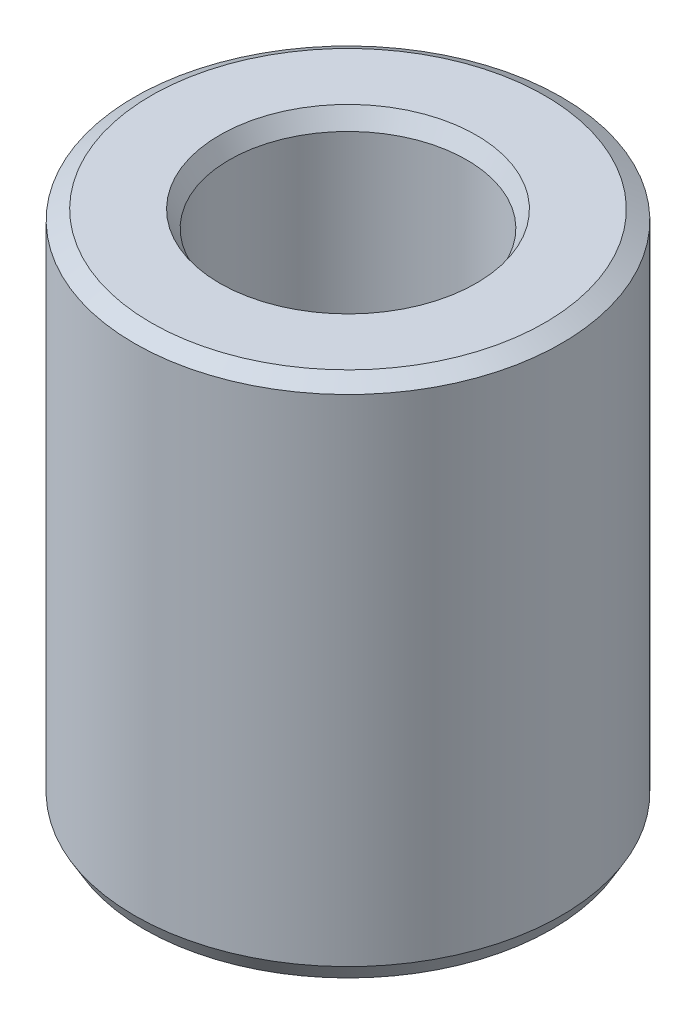
ISO-10303-21;
HEADER;
FILE_DESCRIPTION(('STEP AP214'),'2;1');
FILE_NAME('part.step','',(''),(''),'','','');
FILE_SCHEMA(('AUTOMOTIVE_DESIGN { 1 0 10303 214 1 1 1 1 }'));
ENDSEC;
DATA;
#1=APPLICATION_CONTEXT('core data for automotive mechanical design processes');
#2=APPLICATION_PROTOCOL_DEFINITION('international standard','automotive_design',2000,#1);
#3=PRODUCT_CONTEXT('',#1,'mechanical');
#4=PRODUCT('Part','Part','',(#3));
#5=PRODUCT_RELATED_PRODUCT_CATEGORY('part','',(#4));
#6=PRODUCT_DEFINITION_FORMATION('','',#4);
#7=PRODUCT_DEFINITION_CONTEXT('part definition',#1,'design');
#8=PRODUCT_DEFINITION('design','',#6,#7);
#9=PRODUCT_DEFINITION_SHAPE('','',#8);
#10=(LENGTH_UNIT() NAMED_UNIT(*) SI_UNIT(.MILLI.,.METRE.));
#11=(NAMED_UNIT(*) PLANE_ANGLE_UNIT() SI_UNIT($,.RADIAN.));
#12=(NAMED_UNIT(*) SI_UNIT($,.STERADIAN.) SOLID_ANGLE_UNIT());
#13=UNCERTAINTY_MEASURE_WITH_UNIT(LENGTH_MEASURE(1.E-05),#10,'distance_accuracy_value','');
#14=(GEOMETRIC_REPRESENTATION_CONTEXT(3) GLOBAL_UNCERTAINTY_ASSIGNED_CONTEXT((#13)) GLOBAL_UNIT_ASSIGNED_CONTEXT((#10,
#11,#12)) REPRESENTATION_CONTEXT('',''));
#15=CARTESIAN_POINT('',(0.,0.,0.));
#16=DIRECTION('',(0.,0.,1.));
#17=DIRECTION('',(1.,0.,0.));
#18=AXIS2_PLACEMENT_3D('',#15,#16,#17);
#19=CARTESIAN_POINT('',(0.,85.541448278443,0.));
#20=DIRECTION('',(0.,-1.,0.));
#21=DIRECTION('',(0.,0.,-1.));
#22=AXIS2_PLACEMENT_3D('',#19,#20,#21);
#23=CYLINDRICAL_SURFACE('',#22,35.);
#24=CARTESIAN_POINT('',(0.,2.72550945198191,0.));
#25=DIRECTION('',(0.,1.,0.));
#26=DIRECTION('',(0.,0.,1.));
#27=AXIS2_PLACEMENT_3D('',#24,#25,#26);
#28=CIRCLE('',#27,35.);
#29=CARTESIAN_POINT('',(0.,2.72550945198191,35.));
#30=VERTEX_POINT('',#29);
#31=EDGE_CURVE('E10',#30,#30,#28,.T.);
#32=ORIENTED_EDGE('',*,*,#31,.T.);
#33=EDGE_LOOP('',(#32));
#34=FACE_BOUND('',#33,.T.);
#35=CARTESIAN_POINT('',(0.,83.9678746626624,0.));
#36=DIRECTION('',(0.,1.,0.));
#37=DIRECTION('',(0.,0.,1.));
#38=AXIS2_PLACEMENT_3D('',#35,#36,#37);
#39=CIRCLE('',#38,35.);
#40=CARTESIAN_POINT('',(0.,83.9678746626624,35.));
#41=VERTEX_POINT('',#40);
#42=EDGE_CURVE('E50',#41,#41,#39,.F.);
#43=ORIENTED_EDGE('',*,*,#42,.T.);
#44=EDGE_LOOP('',(#43));
#45=FACE_BOUND('',#44,.T.);
#46=ADVANCED_FACE('F39',(#34,#45),#23,.T.);
#47=CARTESIAN_POINT('',(0.,85.541448278443,0.));
#48=DIRECTION('',(0.,1.,0.));
#49=DIRECTION('',(0.,0.,1.));
#50=AXIS2_PLACEMENT_3D('',#47,#48,#49);
#51=PLANE('',#50);
#52=CARTESIAN_POINT('',(0.,85.541448278443,0.));
#53=DIRECTION('',(0.,1.,0.));
#54=DIRECTION('',(0.,0.,1.));
#55=AXIS2_PLACEMENT_3D('',#52,#53,#54);
#56=CIRCLE('',#55,21.0417153686757);
#57=CARTESIAN_POINT('',(0.,85.541448278443,21.0417153686757));
#58=VERTEX_POINT('',#57);
#59=EDGE_CURVE('E58',#58,#58,#56,.F.);
#60=ORIENTED_EDGE('',*,*,#59,.T.);
#61=EDGE_LOOP('',(#60));
#62=FACE_BOUND('',#61,.T.);
#63=CARTESIAN_POINT('',(0.,85.541448278443,0.));
#64=DIRECTION('',(0.,1.,0.));
#65=DIRECTION('',(0.,0.,1.));
#66=AXIS2_PLACEMENT_3D('',#63,#64,#65);
#67=CIRCLE('',#66,32.2744905480182);
#68=CARTESIAN_POINT('',(0.,85.541448278443,32.2744905480182));
#69=VERTEX_POINT('',#68);
#70=EDGE_CURVE('E61',#69,#69,#67,.T.);
#71=ORIENTED_EDGE('',*,*,#70,.T.);
#72=EDGE_LOOP('',(#71));
#73=FACE_BOUND('',#72,.T.);
#74=ADVANCED_FACE('F88',(#62,#73),#51,.T.);
#75=CARTESIAN_POINT('',(0.,0.,0.));
#76=DIRECTION('',(0.,1.,0.));
#77=DIRECTION('',(0.,0.,1.));
#78=AXIS2_PLACEMENT_3D('',#75,#76,#77);
#79=PLANE('',#78);
#80=CARTESIAN_POINT('',(0.,0.,0.));
#81=DIRECTION('',(0.,1.,0.));
#82=DIRECTION('',(0.,0.,1.));
#83=AXIS2_PLACEMENT_3D('',#80,#81,#82);
#84=CIRCLE('',#83,22.193651204877);
#85=CARTESIAN_POINT('',(0.,0.,22.193651204877));
#86=VERTEX_POINT('',#85);
#87=EDGE_CURVE('E51',#86,#86,#84,.T.);
#88=ORIENTED_EDGE('',*,*,#87,.T.);
#89=EDGE_LOOP('',(#88));
#90=FACE_BOUND('',#89,.T.);
#91=CARTESIAN_POINT('',(0.,0.,0.));
#92=DIRECTION('',(0.,1.,0.));
#93=DIRECTION('',(0.,0.,1.));
#94=AXIS2_PLACEMENT_3D('',#91,#92,#93);
#95=CIRCLE('',#94,33.4264263842194);
#96=CARTESIAN_POINT('',(0.,0.,33.4264263842194));
#97=VERTEX_POINT('',#96);
#98=EDGE_CURVE('E54',#97,#97,#95,.F.);
#99=ORIENTED_EDGE('',*,*,#98,.T.);
#100=EDGE_LOOP('',(#99));
#101=FACE_BOUND('',#100,.T.);
#102=ADVANCED_FACE('F83',(#90,#101),#79,.F.);
#103=CARTESIAN_POINT('',(0.,85.541448278443,0.));
#104=DIRECTION('',(0.,-1.,0.));
#105=DIRECTION('',(0.,0.,-1.));
#106=AXIS2_PLACEMENT_3D('',#103,#104,#105);
#107=CYLINDRICAL_SURFACE('',#106,19.4681417528951);
#108=CARTESIAN_POINT('',(0.,82.8159388264611,0.));
#109=DIRECTION('',(0.,1.,0.));
#110=DIRECTION('',(0.,0.,1.));
#111=AXIS2_PLACEMENT_3D('',#108,#109,#110);
#112=CIRCLE('',#111,19.4681417528951);
#113=CARTESIAN_POINT('',(0.,82.8159388264611,19.4681417528951));
#114=VERTEX_POINT('',#113);
#115=EDGE_CURVE('E67',#114,#114,#112,.T.);
#116=ORIENTED_EDGE('',*,*,#115,.T.);
#117=EDGE_LOOP('',(#116));
#118=FACE_BOUND('',#117,.T.);
#119=CARTESIAN_POINT('',(0.,1.57357361578062,0.));
#120=DIRECTION('',(0.,1.,0.));
#121=DIRECTION('',(0.,0.,1.));
#122=AXIS2_PLACEMENT_3D('',#119,#120,#121);
#123=CIRCLE('',#122,19.4681417528951);
#124=CARTESIAN_POINT('',(0.,1.57357361578062,19.4681417528951));
#125=VERTEX_POINT('',#124);
#126=EDGE_CURVE('E69',#125,#125,#123,.F.);
#127=ORIENTED_EDGE('',*,*,#126,.T.);
#128=EDGE_LOOP('',(#127));
#129=FACE_BOUND('',#128,.T.);
#130=ADVANCED_FACE('F71',(#118,#129),#107,.F.);
#131=CARTESIAN_POINT('',(0.,82.8159388264611,0.));
#132=DIRECTION('',(0.,1.,0.));
#133=DIRECTION('',(0.,0.,1.));
#134=AXIS2_PLACEMENT_3D('',#131,#132,#133);
#135=CONICAL_SURFACE('',#134,19.4681417528951,0.523598775598295);
#136=ORIENTED_EDGE('',*,*,#59,.F.);
#137=EDGE_LOOP('',(#136));
#138=FACE_BOUND('',#137,.T.);
#139=ORIENTED_EDGE('',*,*,#115,.F.);
#140=EDGE_LOOP('',(#139));
#141=FACE_BOUND('',#140,.T.);
#142=ADVANCED_FACE('F77',(#138,#141),#135,.F.);
#143=CARTESIAN_POINT('',(0.,0.,0.));
#144=DIRECTION('',(0.,-1.,0.));
#145=DIRECTION('',(0.,0.,-1.));
#146=AXIS2_PLACEMENT_3D('',#143,#144,#145);
#147=CONICAL_SURFACE('',#146,22.193651204877,1.04719755119659);
#148=ORIENTED_EDGE('',*,*,#126,.F.);
#149=EDGE_LOOP('',(#148));
#150=FACE_BOUND('',#149,.T.);
#151=ORIENTED_EDGE('',*,*,#87,.F.);
#152=EDGE_LOOP('',(#151));
#153=FACE_BOUND('',#152,.T.);
#154=ADVANCED_FACE('F73',(#150,#153),#147,.F.);
#155=CARTESIAN_POINT('',(0.,2.72550945198191,0.));
#156=DIRECTION('',(0.,1.,0.));
#157=DIRECTION('',(0.,0.,1.));
#158=AXIS2_PLACEMENT_3D('',#155,#156,#157);
#159=CONICAL_SURFACE('',#158,35.,0.523598775598302);
#160=ORIENTED_EDGE('',*,*,#98,.F.);
#161=EDGE_LOOP('',(#160));
#162=FACE_BOUND('',#161,.T.);
#163=ORIENTED_EDGE('',*,*,#31,.F.);
#164=EDGE_LOOP('',(#163));
#165=FACE_BOUND('',#164,.T.);
#166=ADVANCED_FACE('F76',(#162,#165),#159,.T.);
#167=CARTESIAN_POINT('',(0.,85.541448278443,0.));
#168=DIRECTION('',(0.,-1.,0.));
#169=DIRECTION('',(0.,0.,-1.));
#170=AXIS2_PLACEMENT_3D('',#167,#168,#169);
#171=CONICAL_SURFACE('',#170,32.2744905480182,1.04719755119659);
#172=ORIENTED_EDGE('',*,*,#42,.F.);
#173=EDGE_LOOP('',(#172));
#174=FACE_BOUND('',#173,.T.);
#175=ORIENTED_EDGE('',*,*,#70,.F.);
#176=EDGE_LOOP('',(#175));
#177=FACE_BOUND('',#176,.T.);
#178=ADVANCED_FACE('F45',(#174,#177),#171,.T.);
#179=CLOSED_SHELL('',(#46,#74,#102,#130,#142,#154,#166,#178));
#180=MANIFOLD_SOLID_BREP('B2',#179);
#181=ADVANCED_BREP_SHAPE_REPRESENTATION('',(#18,#180),#14);
#182=SHAPE_DEFINITION_REPRESENTATION(#9,#181);
ENDSEC;
END-ISO-10303-21;
